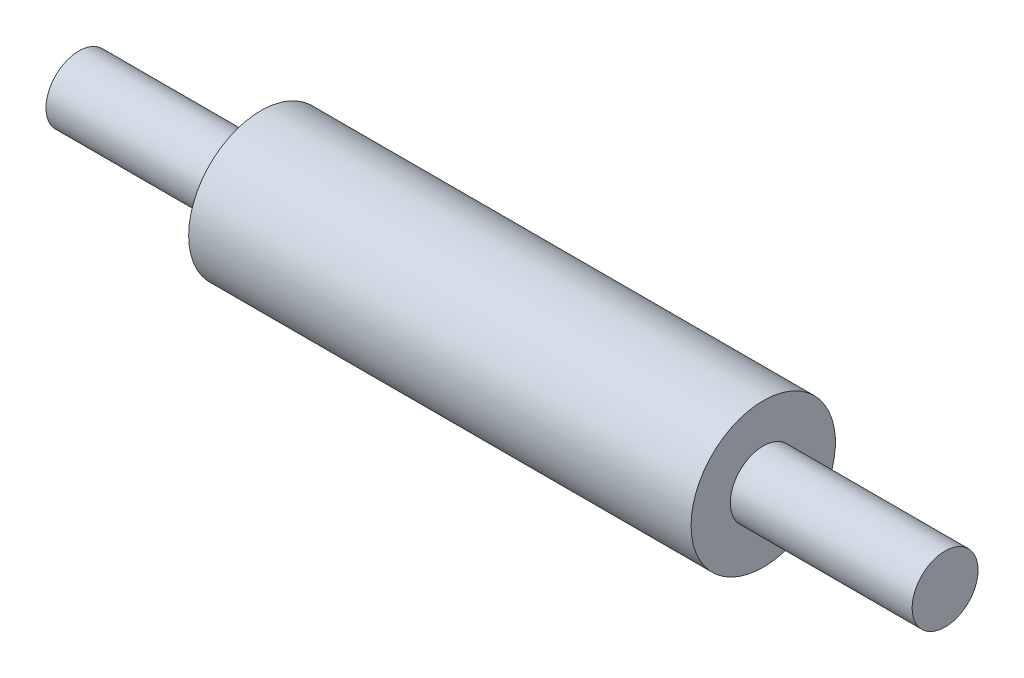
ISO-10303-21;
HEADER;
FILE_DESCRIPTION(('STEP AP214'),'2;1');
FILE_NAME('part.step','',(''),(''),'','','');
FILE_SCHEMA(('AUTOMOTIVE_DESIGN { 1 0 10303 214 1 1 1 1 }'));
ENDSEC;
DATA;
#1=APPLICATION_CONTEXT('core data for automotive mechanical design processes');
#2=APPLICATION_PROTOCOL_DEFINITION('international standard','automotive_design',2000,#1);
#3=PRODUCT_CONTEXT('',#1,'mechanical');
#4=PRODUCT('Part','Part','',(#3));
#5=PRODUCT_RELATED_PRODUCT_CATEGORY('part','',(#4));
#6=PRODUCT_DEFINITION_FORMATION('','',#4);
#7=PRODUCT_DEFINITION_CONTEXT('part definition',#1,'design');
#8=PRODUCT_DEFINITION('design','',#6,#7);
#9=PRODUCT_DEFINITION_SHAPE('','',#8);
#10=(LENGTH_UNIT() NAMED_UNIT(*) SI_UNIT(.MILLI.,.METRE.));
#11=(NAMED_UNIT(*) PLANE_ANGLE_UNIT() SI_UNIT($,.RADIAN.));
#12=(NAMED_UNIT(*) SI_UNIT($,.STERADIAN.) SOLID_ANGLE_UNIT());
#13=UNCERTAINTY_MEASURE_WITH_UNIT(LENGTH_MEASURE(1.E-05),#10,'distance_accuracy_value','');
#14=(GEOMETRIC_REPRESENTATION_CONTEXT(3) GLOBAL_UNCERTAINTY_ASSIGNED_CONTEXT((#13)) GLOBAL_UNIT_ASSIGNED_CONTEXT((#10,
#11,#12)) REPRESENTATION_CONTEXT('',''));
#15=CARTESIAN_POINT('',(0.,0.,0.));
#16=DIRECTION('',(0.,0.,1.));
#17=DIRECTION('',(1.,0.,0.));
#18=AXIS2_PLACEMENT_3D('',#15,#16,#17);
#19=CARTESIAN_POINT('',(-19.4787240201555,0.,0.));
#20=DIRECTION('',(-1.,0.,0.));
#21=DIRECTION('',(0.,0.,1.));
#22=AXIS2_PLACEMENT_3D('',#19,#20,#21);
#23=CYLINDRICAL_SURFACE('',#22,1.5875);
#24=CARTESIAN_POINT('',(0.,0.,0.));
#25=DIRECTION('',(-1.,0.,0.));
#26=DIRECTION('',(0.,0.,1.));
#27=AXIS2_PLACEMENT_3D('',#24,#25,#26);
#28=CIRCLE('',#27,1.5875);
#29=CARTESIAN_POINT('',(0.,0.,1.5875));
#30=VERTEX_POINT('',#29);
#31=EDGE_CURVE('E65',#30,#30,#28,.T.);
#32=ORIENTED_EDGE('',*,*,#31,.F.);
#33=EDGE_LOOP('',(#32));
#34=FACE_BOUND('',#33,.T.);
#35=CARTESIAN_POINT('',(11.05,0.,0.));
#36=DIRECTION('',(-1.,0.,0.));
#37=DIRECTION('',(0.,0.,1.));
#38=AXIS2_PLACEMENT_3D('',#35,#36,#37);
#39=CIRCLE('',#38,1.5875);
#40=CARTESIAN_POINT('',(11.05,0.,1.5875));
#41=VERTEX_POINT('',#40);
#42=EDGE_CURVE('E12',#41,#41,#39,.T.);
#43=ORIENTED_EDGE('',*,*,#42,.T.);
#44=EDGE_LOOP('',(#43));
#45=FACE_BOUND('',#44,.T.);
#46=ADVANCED_FACE('F43',(#34,#45),#23,.T.);
#47=CARTESIAN_POINT('',(11.05,1.5875,0.));
#48=DIRECTION('',(-1.,0.,0.));
#49=DIRECTION('',(0.,0.,1.));
#50=AXIS2_PLACEMENT_3D('',#47,#48,#49);
#51=PLANE('',#50);
#52=ORIENTED_EDGE('',*,*,#42,.F.);
#53=EDGE_LOOP('',(#52));
#54=FACE_BOUND('',#53,.T.);
#55=CARTESIAN_POINT('',(11.05,0.,0.));
#56=DIRECTION('',(-1.,0.,0.));
#57=DIRECTION('',(0.,0.,1.));
#58=AXIS2_PLACEMENT_3D('',#55,#56,#57);
#59=CIRCLE('',#58,0.725);
#60=CARTESIAN_POINT('',(11.05,0.,0.725));
#61=VERTEX_POINT('',#60);
#62=EDGE_CURVE('E49',#61,#61,#59,.T.);
#63=ORIENTED_EDGE('',*,*,#62,.T.);
#64=EDGE_LOOP('',(#63));
#65=FACE_BOUND('',#64,.T.);
#66=ADVANCED_FACE('F72',(#54,#65),#51,.F.);
#67=CARTESIAN_POINT('',(-19.4787240201555,0.,0.));
#68=DIRECTION('',(-1.,0.,0.));
#69=DIRECTION('',(0.,0.,1.));
#70=AXIS2_PLACEMENT_3D('',#67,#68,#69);
#71=CYLINDRICAL_SURFACE('',#70,0.725);
#72=ORIENTED_EDGE('',*,*,#62,.F.);
#73=EDGE_LOOP('',(#72));
#74=FACE_BOUND('',#73,.T.);
#75=CARTESIAN_POINT('',(15.05,0.,0.));
#76=DIRECTION('',(-1.,0.,0.));
#77=DIRECTION('',(0.,0.,1.));
#78=AXIS2_PLACEMENT_3D('',#75,#76,#77);
#79=CIRCLE('',#78,0.725);
#80=CARTESIAN_POINT('',(15.05,0.,0.725));
#81=VERTEX_POINT('',#80);
#82=EDGE_CURVE('E53',#81,#81,#79,.T.);
#83=ORIENTED_EDGE('',*,*,#82,.T.);
#84=EDGE_LOOP('',(#83));
#85=FACE_BOUND('',#84,.T.);
#86=ADVANCED_FACE('F76',(#74,#85),#71,.T.);
#87=CARTESIAN_POINT('',(15.05,0.725,0.));
#88=DIRECTION('',(-1.,0.,0.));
#89=DIRECTION('',(0.,0.,1.));
#90=AXIS2_PLACEMENT_3D('',#87,#88,#89);
#91=PLANE('',#90);
#92=ORIENTED_EDGE('',*,*,#82,.F.);
#93=EDGE_LOOP('',(#92));
#94=FACE_BOUND('',#93,.T.);
#95=ADVANCED_FACE('F81',(#94),#91,.F.);
#96=CARTESIAN_POINT('',(-4.,0.724999999999999,0.));
#97=DIRECTION('',(1.,0.,0.));
#98=DIRECTION('',(0.,0.,-1.));
#99=AXIS2_PLACEMENT_3D('',#96,#97,#98);
#100=PLANE('',#99);
#101=CARTESIAN_POINT('',(-4.,0.,0.));
#102=DIRECTION('',(-1.,0.,0.));
#103=DIRECTION('',(0.,0.,1.));
#104=AXIS2_PLACEMENT_3D('',#101,#102,#103);
#105=CIRCLE('',#104,0.724999999999999);
#106=CARTESIAN_POINT('',(-4.,0.,0.724999999999999));
#107=VERTEX_POINT('',#106);
#108=EDGE_CURVE('E57',#107,#107,#105,.T.);
#109=ORIENTED_EDGE('',*,*,#108,.T.);
#110=EDGE_LOOP('',(#109));
#111=FACE_BOUND('',#110,.T.);
#112=ADVANCED_FACE('F87',(#111),#100,.F.);
#113=CARTESIAN_POINT('',(-19.4787240201555,0.,0.));
#114=DIRECTION('',(-1.,0.,0.));
#115=DIRECTION('',(0.,0.,1.));
#116=AXIS2_PLACEMENT_3D('',#113,#114,#115);
#117=CYLINDRICAL_SURFACE('',#116,0.725);
#118=ORIENTED_EDGE('',*,*,#108,.F.);
#119=EDGE_LOOP('',(#118));
#120=FACE_BOUND('',#119,.T.);
#121=CARTESIAN_POINT('',(0.,0.,0.));
#122=DIRECTION('',(-1.,0.,0.));
#123=DIRECTION('',(0.,0.,1.));
#124=AXIS2_PLACEMENT_3D('',#121,#122,#123);
#125=CIRCLE('',#124,0.725);
#126=CARTESIAN_POINT('',(0.,0.,0.725));
#127=VERTEX_POINT('',#126);
#128=EDGE_CURVE('E62',#127,#127,#125,.T.);
#129=ORIENTED_EDGE('',*,*,#128,.T.);
#130=EDGE_LOOP('',(#129));
#131=FACE_BOUND('',#130,.T.);
#132=ADVANCED_FACE('F91',(#120,#131),#117,.T.);
#133=CARTESIAN_POINT('',(0.,1.5875,0.));
#134=DIRECTION('',(1.,0.,0.));
#135=DIRECTION('',(0.,0.,-1.));
#136=AXIS2_PLACEMENT_3D('',#133,#134,#135);
#137=PLANE('',#136);
#138=ORIENTED_EDGE('',*,*,#128,.F.);
#139=EDGE_LOOP('',(#138));
#140=FACE_BOUND('',#139,.T.);
#141=ORIENTED_EDGE('',*,*,#31,.T.);
#142=EDGE_LOOP('',(#141));
#143=FACE_BOUND('',#142,.T.);
#144=ADVANCED_FACE('F69',(#140,#143),#137,.F.);
#145=CLOSED_SHELL('',(#46,#66,#86,#95,#112,#132,#144));
#146=MANIFOLD_SOLID_BREP('B2',#145);
#147=ADVANCED_BREP_SHAPE_REPRESENTATION('',(#18,#146),#14);
#148=SHAPE_DEFINITION_REPRESENTATION(#9,#147);
ENDSEC;
END-ISO-10303-21;
